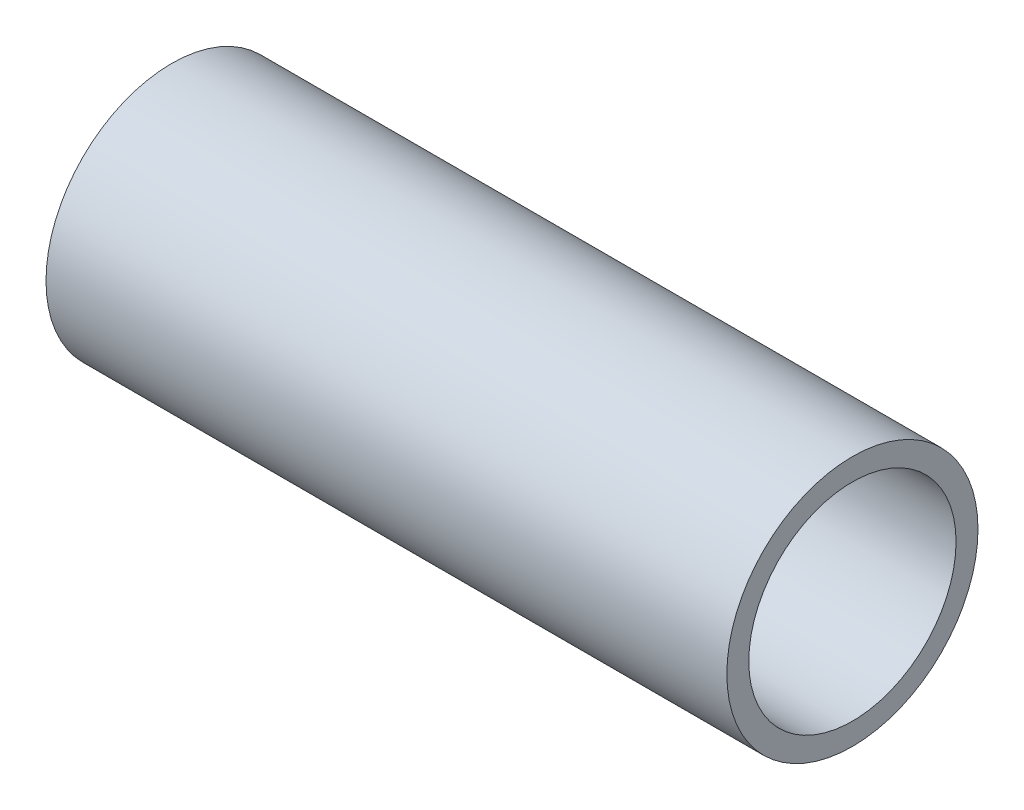
ISO-10303-21;
HEADER;
FILE_DESCRIPTION(('STEP AP214'),'2;1');
FILE_NAME('part.step','',(''),(''),'','','');
FILE_SCHEMA(('AUTOMOTIVE_DESIGN { 1 0 10303 214 1 1 1 1 }'));
ENDSEC;
DATA;
#1=APPLICATION_CONTEXT('core data for automotive mechanical design processes');
#2=APPLICATION_PROTOCOL_DEFINITION('international standard','automotive_design',2000,#1);
#3=PRODUCT_CONTEXT('',#1,'mechanical');
#4=PRODUCT('Part','Part','',(#3));
#5=PRODUCT_RELATED_PRODUCT_CATEGORY('part','',(#4));
#6=PRODUCT_DEFINITION_FORMATION('','',#4);
#7=PRODUCT_DEFINITION_CONTEXT('part definition',#1,'design');
#8=PRODUCT_DEFINITION('design','',#6,#7);
#9=PRODUCT_DEFINITION_SHAPE('','',#8);
#10=(LENGTH_UNIT() NAMED_UNIT(*) SI_UNIT(.MILLI.,.METRE.));
#11=(NAMED_UNIT(*) PLANE_ANGLE_UNIT() SI_UNIT($,.RADIAN.));
#12=(NAMED_UNIT(*) SI_UNIT($,.STERADIAN.) SOLID_ANGLE_UNIT());
#13=UNCERTAINTY_MEASURE_WITH_UNIT(LENGTH_MEASURE(1.E-05),#10,'distance_accuracy_value','');
#14=(GEOMETRIC_REPRESENTATION_CONTEXT(3) GLOBAL_UNCERTAINTY_ASSIGNED_CONTEXT((#13)) GLOBAL_UNIT_ASSIGNED_CONTEXT((#10,
#11,#12)) REPRESENTATION_CONTEXT('',''));
#15=CARTESIAN_POINT('',(0.,0.,0.));
#16=DIRECTION('',(0.,0.,1.));
#17=DIRECTION('',(1.,0.,0.));
#18=AXIS2_PLACEMENT_3D('',#15,#16,#17);
#19=CARTESIAN_POINT('',(-25.0027926040975,0.,0.));
#20=DIRECTION('',(-1.,0.,0.));
#21=DIRECTION('',(0.,0.,1.));
#22=AXIS2_PLACEMENT_3D('',#19,#20,#21);
#23=CYLINDRICAL_SURFACE('',#22,21.082);
#24=CARTESIAN_POINT('',(0.,0.,0.));
#25=DIRECTION('',(-1.,0.,0.));
#26=DIRECTION('',(0.,0.,1.));
#27=AXIS2_PLACEMENT_3D('',#24,#25,#26);
#28=CIRCLE('',#27,21.082);
#29=CARTESIAN_POINT('',(0.,0.,21.082));
#30=VERTEX_POINT('',#29);
#31=EDGE_CURVE('E10',#30,#30,#28,.T.);
#32=ORIENTED_EDGE('',*,*,#31,.F.);
#33=EDGE_LOOP('',(#32));
#34=FACE_BOUND('',#33,.T.);
#35=CARTESIAN_POINT('',(114.3,0.,0.));
#36=DIRECTION('',(-1.,0.,0.));
#37=DIRECTION('',(0.,0.,1.));
#38=AXIS2_PLACEMENT_3D('',#35,#36,#37);
#39=CIRCLE('',#38,21.082);
#40=CARTESIAN_POINT('',(114.3,0.,21.082));
#41=VERTEX_POINT('',#40);
#42=EDGE_CURVE('E45',#41,#41,#39,.T.);
#43=ORIENTED_EDGE('',*,*,#42,.T.);
#44=EDGE_LOOP('',(#43));
#45=FACE_BOUND('',#44,.T.);
#46=ADVANCED_FACE('F31',(#34,#45),#23,.T.);
#47=CARTESIAN_POINT('',(0.,21.082,0.));
#48=DIRECTION('',(1.,0.,0.));
#49=DIRECTION('',(0.,0.,-1.));
#50=AXIS2_PLACEMENT_3D('',#47,#48,#49);
#51=PLANE('',#50);
#52=CARTESIAN_POINT('',(0.,0.,0.));
#53=DIRECTION('',(-1.,0.,0.));
#54=DIRECTION('',(0.,0.,1.));
#55=AXIS2_PLACEMENT_3D('',#52,#53,#54);
#56=CIRCLE('',#55,17.399);
#57=CARTESIAN_POINT('',(0.,0.,17.399));
#58=VERTEX_POINT('',#57);
#59=EDGE_CURVE('E37',#58,#58,#56,.T.);
#60=ORIENTED_EDGE('',*,*,#59,.F.);
#61=EDGE_LOOP('',(#60));
#62=FACE_BOUND('',#61,.T.);
#63=ORIENTED_EDGE('',*,*,#31,.T.);
#64=EDGE_LOOP('',(#63));
#65=FACE_BOUND('',#64,.T.);
#66=ADVANCED_FACE('F60',(#62,#65),#51,.F.);
#67=CARTESIAN_POINT('',(-25.0027926040975,0.,0.));
#68=DIRECTION('',(-1.,0.,0.));
#69=DIRECTION('',(0.,0.,1.));
#70=AXIS2_PLACEMENT_3D('',#67,#68,#69);
#71=CYLINDRICAL_SURFACE('',#70,17.399);
#72=CARTESIAN_POINT('',(114.3,0.,0.));
#73=DIRECTION('',(-1.,0.,0.));
#74=DIRECTION('',(0.,0.,1.));
#75=AXIS2_PLACEMENT_3D('',#72,#73,#74);
#76=CIRCLE('',#75,17.399);
#77=CARTESIAN_POINT('',(114.3,0.,17.399));
#78=VERTEX_POINT('',#77);
#79=EDGE_CURVE('E41',#78,#78,#76,.T.);
#80=ORIENTED_EDGE('',*,*,#79,.F.);
#81=EDGE_LOOP('',(#80));
#82=FACE_BOUND('',#81,.T.);
#83=ORIENTED_EDGE('',*,*,#59,.T.);
#84=EDGE_LOOP('',(#83));
#85=FACE_BOUND('',#84,.T.);
#86=ADVANCED_FACE('F55',(#82,#85),#71,.F.);
#87=CARTESIAN_POINT('',(114.3,17.399,0.));
#88=DIRECTION('',(-1.,0.,0.));
#89=DIRECTION('',(0.,0.,1.));
#90=AXIS2_PLACEMENT_3D('',#87,#88,#89);
#91=PLANE('',#90);
#92=ORIENTED_EDGE('',*,*,#42,.F.);
#93=EDGE_LOOP('',(#92));
#94=FACE_BOUND('',#93,.T.);
#95=ORIENTED_EDGE('',*,*,#79,.T.);
#96=EDGE_LOOP('',(#95));
#97=FACE_BOUND('',#96,.T.);
#98=ADVANCED_FACE('F52',(#94,#97),#91,.F.);
#99=CLOSED_SHELL('',(#46,#66,#86,#98));
#100=MANIFOLD_SOLID_BREP('B2',#99);
#101=ADVANCED_BREP_SHAPE_REPRESENTATION('',(#18,#100),#14);
#102=SHAPE_DEFINITION_REPRESENTATION(#9,#101);
ENDSEC;
END-ISO-10303-21;
